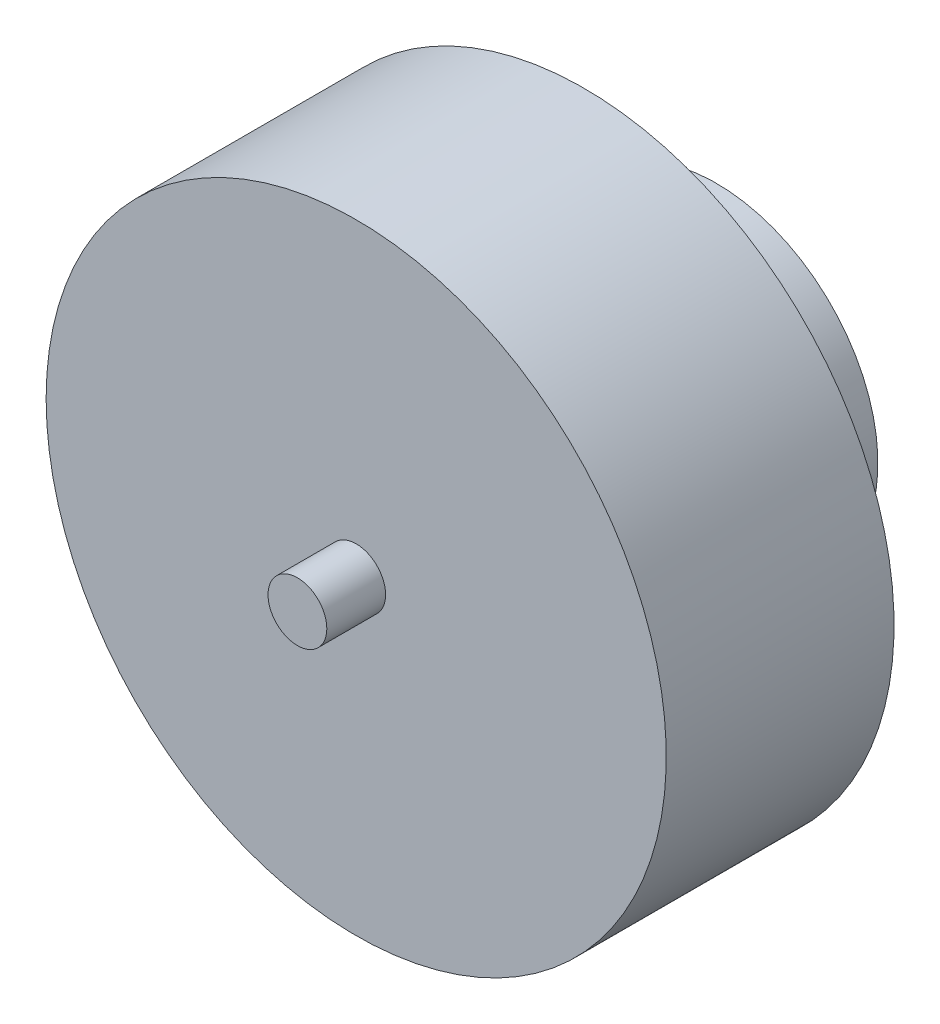
ISO-10303-21;
HEADER;
FILE_DESCRIPTION(('STEP AP214'),'2;1');
FILE_NAME('part.step','',(''),(''),'','','');
FILE_SCHEMA(('AUTOMOTIVE_DESIGN { 1 0 10303 214 1 1 1 1 }'));
ENDSEC;
DATA;
#1=APPLICATION_CONTEXT('core data for automotive mechanical design processes');
#2=APPLICATION_PROTOCOL_DEFINITION('international standard','automotive_design',2000,#1);
#3=PRODUCT_CONTEXT('',#1,'mechanical');
#4=PRODUCT('Part','Part','',(#3));
#5=PRODUCT_RELATED_PRODUCT_CATEGORY('part','',(#4));
#6=PRODUCT_DEFINITION_FORMATION('','',#4);
#7=PRODUCT_DEFINITION_CONTEXT('part definition',#1,'design');
#8=PRODUCT_DEFINITION('design','',#6,#7);
#9=PRODUCT_DEFINITION_SHAPE('','',#8);
#10=(LENGTH_UNIT() NAMED_UNIT(*) SI_UNIT(.MILLI.,.METRE.));
#11=(NAMED_UNIT(*) PLANE_ANGLE_UNIT() SI_UNIT($,.RADIAN.));
#12=(NAMED_UNIT(*) SI_UNIT($,.STERADIAN.) SOLID_ANGLE_UNIT());
#13=UNCERTAINTY_MEASURE_WITH_UNIT(LENGTH_MEASURE(1.E-05),#10,'distance_accuracy_value','');
#14=(GEOMETRIC_REPRESENTATION_CONTEXT(3) GLOBAL_UNCERTAINTY_ASSIGNED_CONTEXT((#13)) GLOBAL_UNIT_ASSIGNED_CONTEXT((#10,
#11,#12)) REPRESENTATION_CONTEXT('',''));
#15=CARTESIAN_POINT('',(0.,0.,0.));
#16=DIRECTION('',(0.,0.,1.));
#17=DIRECTION('',(1.,0.,0.));
#18=AXIS2_PLACEMENT_3D('',#15,#16,#17);
#19=CARTESIAN_POINT('',(0.,0.,0.));
#20=DIRECTION('',(0.,0.,1.));
#21=DIRECTION('',(1.,0.,0.));
#22=AXIS2_PLACEMENT_3D('',#19,#20,#21);
#23=PLANE('',#22);
#24=CARTESIAN_POINT('',(0.,0.,0.));
#25=DIRECTION('',(0.,0.,1.));
#26=DIRECTION('',(1.,0.,0.));
#27=AXIS2_PLACEMENT_3D('',#24,#25,#26);
#28=CIRCLE('',#27,5.5);
#29=CARTESIAN_POINT('',(-5.5,0.,0.));
#30=VERTEX_POINT('',#29);
#31=EDGE_CURVE('E145',#30,#30,#28,.T.);
#32=ORIENTED_EDGE('',*,*,#31,.T.);
#33=EDGE_LOOP('',(#32));
#34=FACE_BOUND('',#33,.T.);
#35=CARTESIAN_POINT('',(0.,0.,0.));
#36=DIRECTION('',(0.,0.,-1.));
#37=DIRECTION('',(1.,0.,0.));
#38=AXIS2_PLACEMENT_3D('',#35,#36,#37);
#39=CIRCLE('',#38,11.180340054099);
#40=CARTESIAN_POINT('',(-11.180340054099,0.,0.));
#41=VERTEX_POINT('',#40);
#42=EDGE_CURVE('E20',#41,#41,#39,.T.);
#43=ORIENTED_EDGE('',*,*,#42,.T.);
#44=EDGE_LOOP('',(#43));
#45=FACE_BOUND('',#44,.T.);
#46=ADVANCED_FACE('F16',(#34,#45),#23,.F.);
#47=CARTESIAN_POINT('',(0.,0.,15.5));
#48=DIRECTION('',(0.,0.,1.));
#49=DIRECTION('',(1.,0.,0.));
#50=AXIS2_PLACEMENT_3D('',#47,#48,#49);
#51=PLANE('',#50);
#52=CARTESIAN_POINT('',(0.,0.,15.5));
#53=DIRECTION('',(0.,0.,-1.));
#54=DIRECTION('',(-1.,0.,0.));
#55=AXIS2_PLACEMENT_3D('',#52,#53,#54);
#56=CIRCLE('',#55,2.);
#57=CARTESIAN_POINT('',(2.,0.,15.5));
#58=VERTEX_POINT('',#57);
#59=EDGE_CURVE('E184',#58,#58,#56,.T.);
#60=ORIENTED_EDGE('',*,*,#59,.T.);
#61=EDGE_LOOP('',(#60));
#62=FACE_BOUND('',#61,.T.);
#63=CARTESIAN_POINT('',(0.,0.,15.5));
#64=DIRECTION('',(0.,0.,1.));
#65=DIRECTION('',(1.,0.,0.));
#66=AXIS2_PLACEMENT_3D('',#63,#64,#65);
#67=CIRCLE('',#66,21.1);
#68=CARTESIAN_POINT('',(-21.1,0.,15.5));
#69=VERTEX_POINT('',#68);
#70=EDGE_CURVE('E27',#69,#69,#67,.T.);
#71=ORIENTED_EDGE('',*,*,#70,.T.);
#72=EDGE_LOOP('',(#71));
#73=FACE_BOUND('',#72,.T.);
#74=ADVANCED_FACE('F18',(#62,#73),#51,.T.);
#75=CARTESIAN_POINT('',(0.,0.,0.));
#76=DIRECTION('',(0.,0.,1.));
#77=DIRECTION('',(1.,0.,0.));
#78=AXIS2_PLACEMENT_3D('',#75,#76,#77);
#79=CYLINDRICAL_SURFACE('',#78,21.1);
#80=ORIENTED_EDGE('',*,*,#70,.F.);
#81=DIRECTION('',(0.,0.,-1.));
#82=VECTOR('',#81,1.);
#83=CARTESIAN_POINT('',(-21.1,0.,0.));
#84=LINE('',#83,#82);
#85=CARTESIAN_POINT('',(-21.1,0.,0.));
#86=VERTEX_POINT('',#85);
#87=EDGE_CURVE('E11',#69,#86,#84,.T.);
#88=ORIENTED_EDGE('',*,*,#87,.T.);
#89=CARTESIAN_POINT('',(0.,0.,0.));
#90=DIRECTION('',(0.,0.,1.));
#91=DIRECTION('',(1.,0.,0.));
#92=AXIS2_PLACEMENT_3D('',#89,#90,#91);
#93=CIRCLE('',#92,21.1);
#94=EDGE_CURVE('E215',#86,#86,#93,.T.);
#95=ORIENTED_EDGE('',*,*,#94,.T.);
#96=ORIENTED_EDGE('',*,*,#87,.F.);
#97=EDGE_LOOP('',(#80,#88,#95,#96));
#98=FACE_BOUND('',#97,.T.);
#99=ADVANCED_FACE('F265',(#98),#79,.T.);
#100=CARTESIAN_POINT('',(0.,0.,19.5));
#101=DIRECTION('',(0.,0.,1.));
#102=DIRECTION('',(1.,0.,0.));
#103=AXIS2_PLACEMENT_3D('',#100,#101,#102);
#104=PLANE('',#103);
#105=CARTESIAN_POINT('',(0.,0.,19.5));
#106=DIRECTION('',(0.,0.,1.));
#107=DIRECTION('',(-1.,0.,0.));
#108=AXIS2_PLACEMENT_3D('',#105,#106,#107);
#109=CIRCLE('',#108,2.);
#110=CARTESIAN_POINT('',(2.,0.,19.5));
#111=VERTEX_POINT('',#110);
#112=EDGE_CURVE('E153',#111,#111,#109,.T.);
#113=ORIENTED_EDGE('',*,*,#112,.T.);
#114=EDGE_LOOP('',(#113));
#115=FACE_BOUND('',#114,.T.);
#116=ADVANCED_FACE('F275',(#115),#104,.T.);
#117=CARTESIAN_POINT('',(0.,0.,15.5));
#118=DIRECTION('',(0.,0.,1.));
#119=DIRECTION('',(-1.,0.,0.));
#120=AXIS2_PLACEMENT_3D('',#117,#118,#119);
#121=CYLINDRICAL_SURFACE('',#120,2.);
#122=ORIENTED_EDGE('',*,*,#112,.F.);
#123=DIRECTION('',(0.,0.,-1.));
#124=VECTOR('',#123,1.);
#125=CARTESIAN_POINT('',(2.,0.,15.5));
#126=LINE('',#125,#124);
#127=EDGE_CURVE('E176',#111,#58,#126,.T.);
#128=ORIENTED_EDGE('',*,*,#127,.T.);
#129=ORIENTED_EDGE('',*,*,#59,.F.);
#130=ORIENTED_EDGE('',*,*,#127,.F.);
#131=EDGE_LOOP('',(#122,#128,#129,#130));
#132=FACE_BOUND('',#131,.T.);
#133=ADVANCED_FACE('F296',(#132),#121,.T.);
#134=CARTESIAN_POINT('',(0.,0.,-9.));
#135=DIRECTION('',(0.,0.,-1.));
#136=DIRECTION('',(0.,-1.,0.));
#137=AXIS2_PLACEMENT_3D('',#134,#135,#136);
#138=PLANE('',#137);
#139=CARTESIAN_POINT('',(0.,9.5,-9.));
#140=DIRECTION('',(0.,0.,1.));
#141=DIRECTION('',(1.,0.,0.));
#142=AXIS2_PLACEMENT_3D('',#139,#140,#141);
#143=CIRCLE('',#142,1.);
#144=CARTESIAN_POINT('',(-1.,9.5,-9.));
#145=VERTEX_POINT('',#144);
#146=EDGE_CURVE('E161',#145,#145,#143,.T.);
#147=ORIENTED_EDGE('',*,*,#146,.T.);
#148=EDGE_LOOP('',(#147));
#149=FACE_BOUND('',#148,.T.);
#150=CARTESIAN_POINT('',(8.,0.,-9.));
#151=DIRECTION('',(0.,0.,1.));
#152=DIRECTION('',(1.,0.,0.));
#153=AXIS2_PLACEMENT_3D('',#150,#151,#152);
#154=CIRCLE('',#153,1.00000001490116);
#155=CARTESIAN_POINT('',(6.99999998509884,0.,-9.));
#156=VERTEX_POINT('',#155);
#157=EDGE_CURVE('E146',#156,#156,#154,.T.);
#158=ORIENTED_EDGE('',*,*,#157,.T.);
#159=EDGE_LOOP('',(#158));
#160=FACE_BOUND('',#159,.T.);
#161=CARTESIAN_POINT('',(-8.,0.,-9.));
#162=DIRECTION('',(0.,0.,1.));
#163=DIRECTION('',(1.,0.,0.));
#164=AXIS2_PLACEMENT_3D('',#161,#162,#163);
#165=CIRCLE('',#164,1.00000001490116);
#166=CARTESIAN_POINT('',(-9.00000001490116,0.,-9.));
#167=VERTEX_POINT('',#166);
#168=EDGE_CURVE('E118',#167,#167,#165,.T.);
#169=ORIENTED_EDGE('',*,*,#168,.T.);
#170=EDGE_LOOP('',(#169));
#171=FACE_BOUND('',#170,.T.);
#172=CARTESIAN_POINT('',(0.,-9.5,-9.));
#173=DIRECTION('',(0.,0.,1.));
#174=DIRECTION('',(1.,0.,0.));
#175=AXIS2_PLACEMENT_3D('',#172,#173,#174);
#176=CIRCLE('',#175,1.);
#177=CARTESIAN_POINT('',(-1.,-9.5,-9.));
#178=VERTEX_POINT('',#177);
#179=EDGE_CURVE('E179',#178,#178,#176,.T.);
#180=ORIENTED_EDGE('',*,*,#179,.T.);
#181=EDGE_LOOP('',(#180));
#182=FACE_BOUND('',#181,.T.);
#183=CARTESIAN_POINT('',(0.,0.,-9.));
#184=DIRECTION('',(0.,0.,-1.));
#185=DIRECTION('',(1.,0.,0.));
#186=AXIS2_PLACEMENT_3D('',#183,#184,#185);
#187=CIRCLE('',#186,11.);
#188=CARTESIAN_POINT('',(-11.,0.,-9.));
#189=VERTEX_POINT('',#188);
#190=EDGE_CURVE('E136',#189,#189,#187,.T.);
#191=ORIENTED_EDGE('',*,*,#190,.T.);
#192=EDGE_LOOP('',(#191));
#193=FACE_BOUND('',#192,.T.);
#194=ADVANCED_FACE('F123',(#149,#160,#171,#182,#193),#138,.T.);
#195=CARTESIAN_POINT('',(0.,0.,0.));
#196=DIRECTION('',(0.,0.,-1.));
#197=DIRECTION('',(1.,0.,0.));
#198=AXIS2_PLACEMENT_3D('',#195,#196,#197);
#199=CYLINDRICAL_SURFACE('',#198,5.5);
#200=CARTESIAN_POINT('',(0.,0.,-6.));
#201=DIRECTION('',(0.,0.,1.));
#202=DIRECTION('',(1.,0.,0.));
#203=AXIS2_PLACEMENT_3D('',#200,#201,#202);
#204=CIRCLE('',#203,5.5);
#205=CARTESIAN_POINT('',(-5.5,0.,-6.));
#206=VERTEX_POINT('',#205);
#207=EDGE_CURVE('E139',#206,#206,#204,.T.);
#208=ORIENTED_EDGE('',*,*,#207,.T.);
#209=DIRECTION('',(0.,0.,1.));
#210=VECTOR('',#209,1.);
#211=CARTESIAN_POINT('',(-5.5,0.,0.));
#212=LINE('',#211,#210);
#213=EDGE_CURVE('E141',#206,#30,#212,.T.);
#214=ORIENTED_EDGE('',*,*,#213,.T.);
#215=ORIENTED_EDGE('',*,*,#31,.F.);
#216=ORIENTED_EDGE('',*,*,#213,.F.);
#217=EDGE_LOOP('',(#208,#214,#215,#216));
#218=FACE_BOUND('',#217,.T.);
#219=ADVANCED_FACE('F271',(#218),#199,.T.);
#220=CARTESIAN_POINT('',(0.,0.,-6.));
#221=DIRECTION('',(0.,0.,-1.));
#222=DIRECTION('',(0.,-1.,0.));
#223=AXIS2_PLACEMENT_3D('',#220,#221,#222);
#224=PLANE('',#223);
#225=ORIENTED_EDGE('',*,*,#207,.F.);
#226=EDGE_LOOP('',(#225));
#227=FACE_BOUND('',#226,.T.);
#228=CARTESIAN_POINT('',(0.,9.5,-6.));
#229=DIRECTION('',(0.,0.,-1.));
#230=DIRECTION('',(1.,0.,0.));
#231=AXIS2_PLACEMENT_3D('',#228,#229,#230);
#232=CIRCLE('',#231,1.);
#233=CARTESIAN_POINT('',(-1.,9.5,-6.));
#234=VERTEX_POINT('',#233);
#235=EDGE_CURVE('E160',#234,#234,#232,.T.);
#236=ORIENTED_EDGE('',*,*,#235,.T.);
#237=EDGE_LOOP('',(#236));
#238=FACE_BOUND('',#237,.T.);
#239=CARTESIAN_POINT('',(8.,0.,-6.));
#240=DIRECTION('',(0.,0.,-1.));
#241=DIRECTION('',(1.,0.,0.));
#242=AXIS2_PLACEMENT_3D('',#239,#240,#241);
#243=CIRCLE('',#242,1.00000001490116);
#244=CARTESIAN_POINT('',(6.99999998509884,0.,-6.));
#245=VERTEX_POINT('',#244);
#246=EDGE_CURVE('E166',#245,#245,#243,.T.);
#247=ORIENTED_EDGE('',*,*,#246,.T.);
#248=EDGE_LOOP('',(#247));
#249=FACE_BOUND('',#248,.T.);
#250=CARTESIAN_POINT('',(-8.,0.,-6.));
#251=DIRECTION('',(0.,0.,-1.));
#252=DIRECTION('',(1.,0.,0.));
#253=AXIS2_PLACEMENT_3D('',#250,#251,#252);
#254=CIRCLE('',#253,1.00000001490116);
#255=CARTESIAN_POINT('',(-9.00000001490116,0.,-6.));
#256=VERTEX_POINT('',#255);
#257=EDGE_CURVE('E119',#256,#256,#254,.T.);
#258=ORIENTED_EDGE('',*,*,#257,.T.);
#259=EDGE_LOOP('',(#258));
#260=FACE_BOUND('',#259,.T.);
#261=CARTESIAN_POINT('',(0.,-9.5,-6.));
#262=DIRECTION('',(0.,0.,-1.));
#263=DIRECTION('',(1.,0.,0.));
#264=AXIS2_PLACEMENT_3D('',#261,#262,#263);
#265=CIRCLE('',#264,1.);
#266=CARTESIAN_POINT('',(-1.,-9.5,-6.));
#267=VERTEX_POINT('',#266);
#268=EDGE_CURVE('E126',#267,#267,#265,.T.);
#269=ORIENTED_EDGE('',*,*,#268,.T.);
#270=EDGE_LOOP('',(#269));
#271=FACE_BOUND('',#270,.T.);
#272=CARTESIAN_POINT('',(0.,0.,-6.));
#273=DIRECTION('',(0.,0.,1.));
#274=DIRECTION('',(1.,0.,0.));
#275=AXIS2_PLACEMENT_3D('',#272,#273,#274);
#276=CIRCLE('',#275,11.);
#277=CARTESIAN_POINT('',(-11.,0.,-6.));
#278=VERTEX_POINT('',#277);
#279=EDGE_CURVE('E156',#278,#278,#276,.T.);
#280=ORIENTED_EDGE('',*,*,#279,.T.);
#281=EDGE_LOOP('',(#280));
#282=FACE_BOUND('',#281,.T.);
#283=ADVANCED_FACE('F267',(#227,#238,#249,#260,#271,#282),#224,.F.);
#284=CARTESIAN_POINT('',(0.,0.,-9.));
#285=DIRECTION('',(0.,0.,1.));
#286=DIRECTION('',(1.,0.,0.));
#287=AXIS2_PLACEMENT_3D('',#284,#285,#286);
#288=CYLINDRICAL_SURFACE('',#287,11.);
#289=ORIENTED_EDGE('',*,*,#279,.F.);
#290=DIRECTION('',(0.,0.,-1.));
#291=VECTOR('',#290,1.);
#292=CARTESIAN_POINT('',(-11.,0.,-9.));
#293=LINE('',#292,#291);
#294=EDGE_CURVE('E140',#278,#189,#293,.T.);
#295=ORIENTED_EDGE('',*,*,#294,.T.);
#296=ORIENTED_EDGE('',*,*,#190,.F.);
#297=ORIENTED_EDGE('',*,*,#294,.F.);
#298=EDGE_LOOP('',(#289,#295,#296,#297));
#299=FACE_BOUND('',#298,.T.);
#300=ADVANCED_FACE('F270',(#299),#288,.T.);
#301=CARTESIAN_POINT('',(0.,9.5,-9.));
#302=DIRECTION('',(0.,0.,1.));
#303=DIRECTION('',(1.,0.,0.));
#304=AXIS2_PLACEMENT_3D('',#301,#302,#303);
#305=CYLINDRICAL_SURFACE('',#304,1.);
#306=ORIENTED_EDGE('',*,*,#146,.F.);
#307=DIRECTION('',(0.,0.,1.));
#308=VECTOR('',#307,1.);
#309=CARTESIAN_POINT('',(-1.,9.5,-9.));
#310=LINE('',#309,#308);
#311=EDGE_CURVE('E165',#145,#234,#310,.T.);
#312=ORIENTED_EDGE('',*,*,#311,.T.);
#313=ORIENTED_EDGE('',*,*,#235,.F.);
#314=ORIENTED_EDGE('',*,*,#311,.F.);
#315=EDGE_LOOP('',(#306,#312,#313,#314));
#316=FACE_BOUND('',#315,.T.);
#317=ADVANCED_FACE('F278',(#316),#305,.F.);
#318=CARTESIAN_POINT('',(8.,0.,-9.));
#319=DIRECTION('',(0.,0.,1.));
#320=DIRECTION('',(1.,0.,0.));
#321=AXIS2_PLACEMENT_3D('',#318,#319,#320);
#322=CYLINDRICAL_SURFACE('',#321,1.00000001490116);
#323=ORIENTED_EDGE('',*,*,#157,.F.);
#324=DIRECTION('',(0.,0.,1.));
#325=VECTOR('',#324,1.);
#326=CARTESIAN_POINT('',(6.99999998509884,0.,-9.));
#327=LINE('',#326,#325);
#328=EDGE_CURVE('E150',#156,#245,#327,.T.);
#329=ORIENTED_EDGE('',*,*,#328,.T.);
#330=ORIENTED_EDGE('',*,*,#246,.F.);
#331=ORIENTED_EDGE('',*,*,#328,.F.);
#332=EDGE_LOOP('',(#323,#329,#330,#331));
#333=FACE_BOUND('',#332,.T.);
#334=ADVANCED_FACE('F281',(#333),#322,.F.);
#335=CARTESIAN_POINT('',(-8.,0.,-9.));
#336=DIRECTION('',(0.,0.,1.));
#337=DIRECTION('',(1.,0.,0.));
#338=AXIS2_PLACEMENT_3D('',#335,#336,#337);
#339=CYLINDRICAL_SURFACE('',#338,1.00000001490116);
#340=ORIENTED_EDGE('',*,*,#168,.F.);
#341=DIRECTION('',(0.,0.,1.));
#342=VECTOR('',#341,1.);
#343=CARTESIAN_POINT('',(-9.00000001490116,0.,-9.));
#344=LINE('',#343,#342);
#345=EDGE_CURVE('E115',#167,#256,#344,.T.);
#346=ORIENTED_EDGE('',*,*,#345,.T.);
#347=ORIENTED_EDGE('',*,*,#257,.F.);
#348=ORIENTED_EDGE('',*,*,#345,.F.);
#349=EDGE_LOOP('',(#340,#346,#347,#348));
#350=FACE_BOUND('',#349,.T.);
#351=ADVANCED_FACE('F117',(#350),#339,.F.);
#352=CARTESIAN_POINT('',(0.,-9.5,-9.));
#353=DIRECTION('',(0.,0.,1.));
#354=DIRECTION('',(1.,0.,0.));
#355=AXIS2_PLACEMENT_3D('',#352,#353,#354);
#356=CYLINDRICAL_SURFACE('',#355,1.);
#357=ORIENTED_EDGE('',*,*,#179,.F.);
#358=DIRECTION('',(0.,0.,1.));
#359=VECTOR('',#358,1.);
#360=CARTESIAN_POINT('',(-1.,-9.5,-9.));
#361=LINE('',#360,#359);
#362=EDGE_CURVE('E132',#178,#267,#361,.T.);
#363=ORIENTED_EDGE('',*,*,#362,.T.);
#364=ORIENTED_EDGE('',*,*,#268,.F.);
#365=ORIENTED_EDGE('',*,*,#362,.F.);
#366=EDGE_LOOP('',(#357,#363,#364,#365));
#367=FACE_BOUND('',#366,.T.);
#368=ADVANCED_FACE('F256',(#367),#356,.F.);
#369=CARTESIAN_POINT('',(0.,0.,0.));
#370=DIRECTION('',(0.,0.,1.));
#371=DIRECTION('',(1.,0.,0.));
#372=AXIS2_PLACEMENT_3D('',#369,#370,#371);
#373=PLANE('',#372);
#374=CARTESIAN_POINT('',(0.,0.,0.));
#375=DIRECTION('',(0.,0.,1.));
#376=DIRECTION('',(1.,0.,0.));
#377=AXIS2_PLACEMENT_3D('',#374,#375,#376);
#378=CIRCLE('',#377,19.1049734592291);
#379=CARTESIAN_POINT('',(-19.1049734592291,0.,0.));
#380=VERTEX_POINT('',#379);
#381=EDGE_CURVE('E200',#380,#380,#378,.T.);
#382=ORIENTED_EDGE('',*,*,#381,.T.);
#383=EDGE_LOOP('',(#382));
#384=FACE_BOUND('',#383,.T.);
#385=ORIENTED_EDGE('',*,*,#94,.F.);
#386=EDGE_LOOP('',(#385));
#387=FACE_BOUND('',#386,.T.);
#388=ADVANCED_FACE('F248',(#384,#387),#373,.F.);
#389=CARTESIAN_POINT('',(0.,0.,12.76));
#390=DIRECTION('',(0.,0.,-1.));
#391=DIRECTION('',(0.,-1.,0.));
#392=AXIS2_PLACEMENT_3D('',#389,#390,#391);
#393=PLANE('',#392);
#394=CARTESIAN_POINT('',(0.,0.,12.76));
#395=DIRECTION('',(0.,0.,-1.));
#396=DIRECTION('',(1.,0.,0.));
#397=AXIS2_PLACEMENT_3D('',#394,#395,#396);
#398=CIRCLE('',#397,11.180340054099);
#399=CARTESIAN_POINT('',(-11.180340054099,0.,12.76));
#400=VERTEX_POINT('',#399);
#401=EDGE_CURVE('E204',#400,#400,#398,.T.);
#402=ORIENTED_EDGE('',*,*,#401,.F.);
#403=EDGE_LOOP('',(#402));
#404=FACE_BOUND('',#403,.T.);
#405=CARTESIAN_POINT('',(0.,0.,12.76));
#406=DIRECTION('',(0.,0.,1.));
#407=DIRECTION('',(1.,0.,0.));
#408=AXIS2_PLACEMENT_3D('',#405,#406,#407);
#409=CIRCLE('',#408,19.1049734592291);
#410=CARTESIAN_POINT('',(-19.1049734592291,0.,12.76));
#411=VERTEX_POINT('',#410);
#412=EDGE_CURVE('E209',#411,#411,#409,.T.);
#413=ORIENTED_EDGE('',*,*,#412,.F.);
#414=EDGE_LOOP('',(#413));
#415=FACE_BOUND('',#414,.T.);
#416=ADVANCED_FACE('F244',(#404,#415),#393,.T.);
#417=CARTESIAN_POINT('',(0.,0.,0.));
#418=DIRECTION('',(0.,0.,1.));
#419=DIRECTION('',(1.,0.,0.));
#420=AXIS2_PLACEMENT_3D('',#417,#418,#419);
#421=CYLINDRICAL_SURFACE('',#420,19.1049734592291);
#422=ORIENTED_EDGE('',*,*,#381,.F.);
#423=DIRECTION('',(0.,0.,1.));
#424=VECTOR('',#423,1.);
#425=CARTESIAN_POINT('',(-19.1049734592291,0.,0.));
#426=LINE('',#425,#424);
#427=EDGE_CURVE('E203',#380,#411,#426,.T.);
#428=ORIENTED_EDGE('',*,*,#427,.T.);
#429=ORIENTED_EDGE('',*,*,#412,.T.);
#430=ORIENTED_EDGE('',*,*,#427,.F.);
#431=EDGE_LOOP('',(#422,#428,#429,#430));
#432=FACE_BOUND('',#431,.T.);
#433=ADVANCED_FACE('F247',(#432),#421,.F.);
#434=CARTESIAN_POINT('',(0.,0.,0.));
#435=DIRECTION('',(0.,0.,1.));
#436=DIRECTION('',(1.,0.,0.));
#437=AXIS2_PLACEMENT_3D('',#434,#435,#436);
#438=CYLINDRICAL_SURFACE('',#437,11.180340054099);
#439=ORIENTED_EDGE('',*,*,#42,.F.);
#440=DIRECTION('',(0.,0.,1.));
#441=VECTOR('',#440,1.);
#442=CARTESIAN_POINT('',(-11.180340054099,0.,0.));
#443=LINE('',#442,#441);
#444=EDGE_CURVE('E227',#41,#400,#443,.T.);
#445=ORIENTED_EDGE('',*,*,#444,.T.);
#446=ORIENTED_EDGE('',*,*,#401,.T.);
#447=ORIENTED_EDGE('',*,*,#444,.F.);
#448=EDGE_LOOP('',(#439,#445,#446,#447));
#449=FACE_BOUND('',#448,.T.);
#450=ADVANCED_FACE('F241',(#449),#438,.T.);
#451=CLOSED_SHELL('',(#46,#74,#99,#116,#133,#194,#219,#283,#300,#317,#334,#351,#368,#388,#416,
#433,#450));
#452=MANIFOLD_SOLID_BREP('B1',#451);
#453=ADVANCED_BREP_SHAPE_REPRESENTATION('',(#18,#452),#14);
#454=SHAPE_DEFINITION_REPRESENTATION(#9,#453);
ENDSEC;
END-ISO-10303-21;
